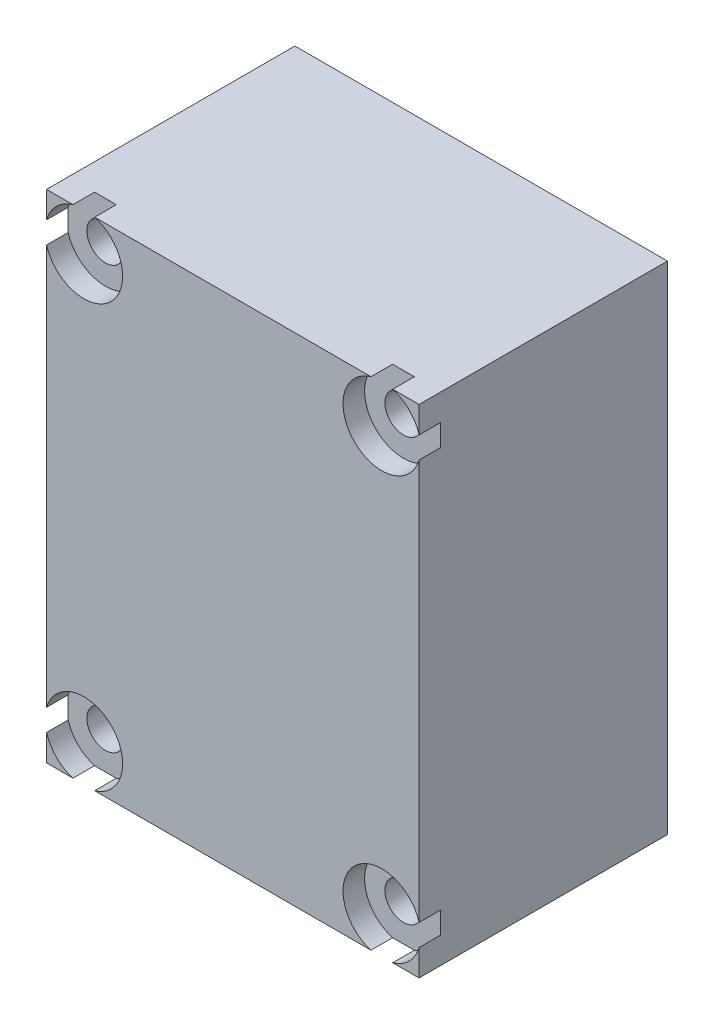
ISO-10303-21;
HEADER;
FILE_DESCRIPTION(('STEP AP214'),'2;1');
FILE_NAME('part.step','',(''),(''),'','','');
FILE_SCHEMA(('AUTOMOTIVE_DESIGN { 1 0 10303 214 1 1 1 1 }'));
ENDSEC;
DATA;
#1=APPLICATION_CONTEXT('core data for automotive mechanical design processes');
#2=APPLICATION_PROTOCOL_DEFINITION('international standard','automotive_design',2000,#1);
#3=PRODUCT_CONTEXT('',#1,'mechanical');
#4=PRODUCT('Part','Part','',(#3));
#5=PRODUCT_RELATED_PRODUCT_CATEGORY('part','',(#4));
#6=PRODUCT_DEFINITION_FORMATION('','',#4);
#7=PRODUCT_DEFINITION_CONTEXT('part definition',#1,'design');
#8=PRODUCT_DEFINITION('design','',#6,#7);
#9=PRODUCT_DEFINITION_SHAPE('','',#8);
#10=(LENGTH_UNIT() NAMED_UNIT(*) SI_UNIT(.MILLI.,.METRE.));
#11=(NAMED_UNIT(*) PLANE_ANGLE_UNIT() SI_UNIT($,.RADIAN.));
#12=(NAMED_UNIT(*) SI_UNIT($,.STERADIAN.) SOLID_ANGLE_UNIT());
#13=UNCERTAINTY_MEASURE_WITH_UNIT(LENGTH_MEASURE(1.E-05),#10,'distance_accuracy_value','');
#14=(GEOMETRIC_REPRESENTATION_CONTEXT(3) GLOBAL_UNCERTAINTY_ASSIGNED_CONTEXT((#13)) GLOBAL_UNIT_ASSIGNED_CONTEXT((#10,
#11,#12)) REPRESENTATION_CONTEXT('',''));
#15=CARTESIAN_POINT('',(0.,0.,0.));
#16=DIRECTION('',(0.,0.,1.));
#17=DIRECTION('',(1.,0.,0.));
#18=AXIS2_PLACEMENT_3D('',#15,#16,#17);
#19=CARTESIAN_POINT('',(0.,0.,25.4));
#20=DIRECTION('',(0.,0.,1.));
#21=DIRECTION('',(1.,0.,0.));
#22=AXIS2_PLACEMENT_3D('',#19,#20,#21);
#23=PLANE('',#22);
#24=CARTESIAN_POINT('',(-47.7550602409639,35.4375903614458,25.4));
#25=DIRECTION('',(0.,0.,1.));
#26=DIRECTION('',(1.,0.,0.));
#27=AXIS2_PLACEMENT_3D('',#24,#25,#26);
#28=CIRCLE('',#27,3.96875);
#29=CARTESIAN_POINT('',(-48.8663102409638,39.2475903614458,25.4));
#30=VERTEX_POINT('',#29);
#31=CARTESIAN_POINT('',(-51.5650602409639,36.5488403614458,25.4));
#32=VERTEX_POINT('',#31);
#33=EDGE_CURVE('E184',#30,#32,#28,.T.);
#34=ORIENTED_EDGE('',*,*,#33,.F.);
#35=DIRECTION('',(-1.,0.,0.));
#36=VECTOR('',#35,1.);
#37=CARTESIAN_POINT('',(-51.5650602409639,39.2475903614458,25.4));
#38=LINE('',#37,#36);
#39=CARTESIAN_POINT('',(-51.5650602409639,39.2475903614458,25.4));
#40=VERTEX_POINT('',#39);
#41=EDGE_CURVE('E245',#30,#40,#38,.T.);
#42=ORIENTED_EDGE('',*,*,#41,.T.);
#43=DIRECTION('',(0.,-1.,0.));
#44=VECTOR('',#43,1.);
#45=CARTESIAN_POINT('',(-51.5650602409639,39.2475903614458,25.4));
#46=LINE('',#45,#44);
#47=EDGE_CURVE('E256',#40,#32,#46,.T.);
#48=ORIENTED_EDGE('',*,*,#47,.T.);
#49=EDGE_LOOP('',(#34,#42,#48));
#50=FACE_BOUND('',#49,.T.);
#51=ADVANCED_FACE('F33',(#50),#23,.T.);
#52=CARTESIAN_POINT('',(-17.2750602409638,35.4375903614458,25.4));
#53=DIRECTION('',(0.,0.,1.));
#54=DIRECTION('',(1.,0.,0.));
#55=AXIS2_PLACEMENT_3D('',#52,#53,#54);
#56=CIRCLE('',#55,3.96875);
#57=CARTESIAN_POINT('',(-13.4650602409638,36.5488403614458,25.4));
#58=VERTEX_POINT('',#57);
#59=CARTESIAN_POINT('',(-16.1638102409638,39.2475903614458,25.4));
#60=VERTEX_POINT('',#59);
#61=EDGE_CURVE('E322',#58,#60,#56,.T.);
#62=ORIENTED_EDGE('',*,*,#61,.F.);
#63=DIRECTION('',(0.,1.,0.));
#64=VECTOR('',#63,1.);
#65=CARTESIAN_POINT('',(-13.4650602409638,39.2475903614458,25.4));
#66=LINE('',#65,#64);
#67=CARTESIAN_POINT('',(-13.4650602409638,39.2475903614458,25.4));
#68=VERTEX_POINT('',#67);
#69=EDGE_CURVE('E250',#58,#68,#66,.T.);
#70=ORIENTED_EDGE('',*,*,#69,.T.);
#71=EDGE_CURVE('E230',#68,#60,#38,.T.);
#72=ORIENTED_EDGE('',*,*,#71,.T.);
#73=EDGE_LOOP('',(#62,#70,#72));
#74=FACE_BOUND('',#73,.T.);
#75=ADVANCED_FACE('F392',(#74),#23,.T.);
#76=CARTESIAN_POINT('',(-47.7550602409639,-7.74240963855422,25.4));
#77=DIRECTION('',(0.,0.,1.));
#78=DIRECTION('',(1.,0.,0.));
#79=AXIS2_PLACEMENT_3D('',#76,#77,#78);
#80=CIRCLE('',#79,3.96875);
#81=CARTESIAN_POINT('',(-51.5650602409639,-8.85365963855422,25.4));
#82=VERTEX_POINT('',#81);
#83=CARTESIAN_POINT('',(-48.8663102409638,-11.5524096385542,25.4));
#84=VERTEX_POINT('',#83);
#85=EDGE_CURVE('E301',#82,#84,#80,.T.);
#86=ORIENTED_EDGE('',*,*,#85,.F.);
#87=CARTESIAN_POINT('',(-51.5650602409639,-11.5524096385542,25.4));
#88=VERTEX_POINT('',#87);
#89=EDGE_CURVE('E233',#82,#88,#46,.T.);
#90=ORIENTED_EDGE('',*,*,#89,.T.);
#91=DIRECTION('',(1.,0.,0.));
#92=VECTOR('',#91,1.);
#93=CARTESIAN_POINT('',(-51.5650602409639,-11.5524096385542,25.4));
#94=LINE('',#93,#92);
#95=EDGE_CURVE('E251',#88,#84,#94,.T.);
#96=ORIENTED_EDGE('',*,*,#95,.T.);
#97=EDGE_LOOP('',(#86,#90,#96));
#98=FACE_BOUND('',#97,.T.);
#99=ADVANCED_FACE('F417',(#98),#23,.T.);
#100=CARTESIAN_POINT('',(-51.5650602409639,34.3263403614458,25.4));
#101=VERTEX_POINT('',#100);
#102=CARTESIAN_POINT('',(-46.6438102409639,39.2475903614458,25.4));
#103=VERTEX_POINT('',#102);
#104=EDGE_CURVE('E174',#101,#103,#28,.T.);
#105=ORIENTED_EDGE('',*,*,#104,.F.);
#106=CARTESIAN_POINT('',(-51.5650602409639,-6.63115963855423,25.4));
#107=VERTEX_POINT('',#106);
#108=EDGE_CURVE('E259',#101,#107,#46,.T.);
#109=ORIENTED_EDGE('',*,*,#108,.T.);
#110=CARTESIAN_POINT('',(-46.6438102409639,-11.5524096385542,25.4));
#111=VERTEX_POINT('',#110);
#112=EDGE_CURVE('E302',#111,#107,#80,.T.);
#113=ORIENTED_EDGE('',*,*,#112,.F.);
#114=CARTESIAN_POINT('',(-18.3863102409638,-11.5524096385542,25.4));
#115=VERTEX_POINT('',#114);
#116=EDGE_CURVE('E254',#111,#115,#94,.T.);
#117=ORIENTED_EDGE('',*,*,#116,.T.);
#118=CARTESIAN_POINT('',(-17.2750602409638,-7.74240963855423,25.4));
#119=DIRECTION('',(0.,0.,1.));
#120=DIRECTION('',(1.,0.,0.));
#121=AXIS2_PLACEMENT_3D('',#118,#119,#120);
#122=CIRCLE('',#121,3.96875);
#123=CARTESIAN_POINT('',(-13.4650602409638,-6.63115963855423,25.4));
#124=VERTEX_POINT('',#123);
#125=EDGE_CURVE('E278',#124,#115,#122,.T.);
#126=ORIENTED_EDGE('',*,*,#125,.F.);
#127=CARTESIAN_POINT('',(-13.4650602409638,34.3263403614457,25.4));
#128=VERTEX_POINT('',#127);
#129=EDGE_CURVE('E249',#124,#128,#66,.T.);
#130=ORIENTED_EDGE('',*,*,#129,.T.);
#131=CARTESIAN_POINT('',(-18.3863102409638,39.2475903614458,25.4));
#132=VERTEX_POINT('',#131);
#133=EDGE_CURVE('E324',#132,#128,#56,.T.);
#134=ORIENTED_EDGE('',*,*,#133,.F.);
#135=EDGE_CURVE('E244',#132,#103,#38,.T.);
#136=ORIENTED_EDGE('',*,*,#135,.T.);
#137=EDGE_LOOP('',(#105,#109,#113,#117,#126,#130,#134,#136));
#138=FACE_BOUND('',#137,.T.);
#139=ADVANCED_FACE('F359',(#138),#23,.T.);
#140=CARTESIAN_POINT('',(-51.5650602409639,39.2475903614458,25.4));
#141=DIRECTION('',(1.,0.,0.));
#142=DIRECTION('',(0.,0.,-1.));
#143=AXIS2_PLACEMENT_3D('',#140,#141,#142);
#144=PLANE('',#143);
#145=DIRECTION('',(0.,1.,0.));
#146=VECTOR('',#145,1.);
#147=CARTESIAN_POINT('',(-51.5650602409639,39.2475903614458,23.1902));
#148=LINE('',#147,#146);
#149=CARTESIAN_POINT('',(-51.5650602409639,34.3263403614458,23.1902));
#150=VERTEX_POINT('',#149);
#151=CARTESIAN_POINT('',(-51.5650602409639,36.5488403614458,23.1902));
#152=VERTEX_POINT('',#151);
#153=EDGE_CURVE('E183',#150,#152,#148,.T.);
#154=ORIENTED_EDGE('',*,*,#153,.T.);
#155=DIRECTION('',(0.,0.,1.));
#156=VECTOR('',#155,1.);
#157=CARTESIAN_POINT('',(-51.5650602409639,36.5488403614458,25.4));
#158=LINE('',#157,#156);
#159=EDGE_CURVE('E326',#152,#32,#158,.T.);
#160=ORIENTED_EDGE('',*,*,#159,.T.);
#161=ORIENTED_EDGE('',*,*,#47,.F.);
#162=DIRECTION('',(0.,0.,-1.));
#163=VECTOR('',#162,1.);
#164=CARTESIAN_POINT('',(-51.5650602409639,39.2475903614458,25.4));
#165=LINE('',#164,#163);
#166=CARTESIAN_POINT('',(-51.5650602409639,39.2475903614458,0.));
#167=VERTEX_POINT('',#166);
#168=EDGE_CURVE('E227',#40,#167,#165,.T.);
#169=ORIENTED_EDGE('',*,*,#168,.T.);
#170=DIRECTION('',(0.,-1.,0.));
#171=VECTOR('',#170,1.);
#172=CARTESIAN_POINT('',(-51.5650602409639,39.2475903614458,0.));
#173=LINE('',#172,#171);
#174=CARTESIAN_POINT('',(-51.5650602409639,-11.5524096385542,0.));
#175=VERTEX_POINT('',#174);
#176=EDGE_CURVE('E238',#167,#175,#173,.T.);
#177=ORIENTED_EDGE('',*,*,#176,.T.);
#178=DIRECTION('',(0.,0.,-1.));
#179=VECTOR('',#178,1.);
#180=CARTESIAN_POINT('',(-51.5650602409639,-11.5524096385542,25.4));
#181=LINE('',#180,#179);
#182=EDGE_CURVE('E218',#88,#175,#181,.T.);
#183=ORIENTED_EDGE('',*,*,#182,.F.);
#184=ORIENTED_EDGE('',*,*,#89,.F.);
#185=DIRECTION('',(0.,0.,1.));
#186=VECTOR('',#185,1.);
#187=CARTESIAN_POINT('',(-51.5650602409639,-8.85365963855422,25.4));
#188=LINE('',#187,#186);
#189=CARTESIAN_POINT('',(-51.5650602409639,-8.85365963855422,23.1902));
#190=VERTEX_POINT('',#189);
#191=EDGE_CURVE('E206',#82,#190,#188,.F.);
#192=ORIENTED_EDGE('',*,*,#191,.T.);
#193=DIRECTION('',(0.,1.,0.));
#194=VECTOR('',#193,1.);
#195=CARTESIAN_POINT('',(-51.5650602409639,39.2475903614458,23.1902));
#196=LINE('',#195,#194);
#197=CARTESIAN_POINT('',(-51.5650602409639,-6.63115963855423,23.1902));
#198=VERTEX_POINT('',#197);
#199=EDGE_CURVE('E203',#190,#198,#196,.T.);
#200=ORIENTED_EDGE('',*,*,#199,.T.);
#201=DIRECTION('',(0.,0.,1.));
#202=VECTOR('',#201,1.);
#203=CARTESIAN_POINT('',(-51.5650602409639,-6.63115963855423,25.4));
#204=LINE('',#203,#202);
#205=EDGE_CURVE('E200',#198,#107,#204,.T.);
#206=ORIENTED_EDGE('',*,*,#205,.T.);
#207=ORIENTED_EDGE('',*,*,#108,.F.);
#208=DIRECTION('',(0.,0.,1.));
#209=VECTOR('',#208,1.);
#210=CARTESIAN_POINT('',(-51.5650602409639,34.3263403614458,25.4));
#211=LINE('',#210,#209);
#212=EDGE_CURVE('E329',#101,#150,#211,.F.);
#213=ORIENTED_EDGE('',*,*,#212,.T.);
#214=EDGE_LOOP('',(#154,#160,#161,#169,#177,#183,#184,#192,#200,#206,#207,#213));
#215=FACE_BOUND('',#214,.T.);
#216=ADVANCED_FACE('F35',(#215),#144,.F.);
#217=CARTESIAN_POINT('',(-51.5650602409639,-11.5524096385542,25.4));
#218=DIRECTION('',(0.,1.,0.));
#219=DIRECTION('',(-1.,0.,0.));
#220=AXIS2_PLACEMENT_3D('',#217,#218,#219);
#221=PLANE('',#220);
#222=DIRECTION('',(-1.,0.,0.));
#223=VECTOR('',#222,1.);
#224=CARTESIAN_POINT('',(-51.5650602409639,-11.5524096385542,23.1902));
#225=LINE('',#224,#223);
#226=CARTESIAN_POINT('',(-46.6438102409639,-11.5524096385542,23.1902));
#227=VERTEX_POINT('',#226);
#228=CARTESIAN_POINT('',(-48.8663102409638,-11.5524096385542,23.1902));
#229=VERTEX_POINT('',#228);
#230=EDGE_CURVE('E282',#227,#229,#225,.T.);
#231=ORIENTED_EDGE('',*,*,#230,.T.);
#232=DIRECTION('',(0.,0.,1.));
#233=VECTOR('',#232,1.);
#234=CARTESIAN_POINT('',(-48.8663102409638,-11.5524096385542,25.4));
#235=LINE('',#234,#233);
#236=EDGE_CURVE('E285',#229,#84,#235,.T.);
#237=ORIENTED_EDGE('',*,*,#236,.T.);
#238=ORIENTED_EDGE('',*,*,#95,.F.);
#239=ORIENTED_EDGE('',*,*,#182,.T.);
#240=DIRECTION('',(1.,0.,0.));
#241=VECTOR('',#240,1.);
#242=CARTESIAN_POINT('',(-51.5650602409639,-11.5524096385542,0.));
#243=LINE('',#242,#241);
#244=CARTESIAN_POINT('',(-13.4650602409638,-11.5524096385542,0.));
#245=VERTEX_POINT('',#244);
#246=EDGE_CURVE('E236',#175,#245,#243,.T.);
#247=ORIENTED_EDGE('',*,*,#246,.T.);
#248=DIRECTION('',(0.,0.,-1.));
#249=VECTOR('',#248,1.);
#250=CARTESIAN_POINT('',(-13.4650602409638,-11.5524096385542,25.4));
#251=LINE('',#250,#249);
#252=CARTESIAN_POINT('',(-13.4650602409638,-11.5524096385542,25.4));
#253=VERTEX_POINT('',#252);
#254=EDGE_CURVE('E221',#253,#245,#251,.T.);
#255=ORIENTED_EDGE('',*,*,#254,.F.);
#256=CARTESIAN_POINT('',(-16.1638102409639,-11.5524096385542,25.4));
#257=VERTEX_POINT('',#256);
#258=EDGE_CURVE('E255',#257,#253,#94,.T.);
#259=ORIENTED_EDGE('',*,*,#258,.F.);
#260=DIRECTION('',(0.,0.,1.));
#261=VECTOR('',#260,1.);
#262=CARTESIAN_POINT('',(-16.1638102409639,-11.5524096385542,25.4));
#263=LINE('',#262,#261);
#264=CARTESIAN_POINT('',(-16.1638102409639,-11.5524096385542,23.1902));
#265=VERTEX_POINT('',#264);
#266=EDGE_CURVE('E265',#257,#265,#263,.F.);
#267=ORIENTED_EDGE('',*,*,#266,.T.);
#268=DIRECTION('',(-1.,0.,0.));
#269=VECTOR('',#268,1.);
#270=CARTESIAN_POINT('',(-51.5650602409639,-11.5524096385542,23.1902));
#271=LINE('',#270,#269);
#272=CARTESIAN_POINT('',(-18.3863102409638,-11.5524096385542,23.1902));
#273=VERTEX_POINT('',#272);
#274=EDGE_CURVE('E241',#265,#273,#271,.T.);
#275=ORIENTED_EDGE('',*,*,#274,.T.);
#276=DIRECTION('',(0.,0.,1.));
#277=VECTOR('',#276,1.);
#278=CARTESIAN_POINT('',(-18.3863102409638,-11.5524096385542,25.4));
#279=LINE('',#278,#277);
#280=EDGE_CURVE('E262',#273,#115,#279,.T.);
#281=ORIENTED_EDGE('',*,*,#280,.T.);
#282=ORIENTED_EDGE('',*,*,#116,.F.);
#283=DIRECTION('',(0.,0.,1.));
#284=VECTOR('',#283,1.);
#285=CARTESIAN_POINT('',(-46.6438102409639,-11.5524096385542,25.4));
#286=LINE('',#285,#284);
#287=EDGE_CURVE('E288',#111,#227,#286,.F.);
#288=ORIENTED_EDGE('',*,*,#287,.T.);
#289=EDGE_LOOP('',(#231,#237,#238,#239,#247,#255,#259,#267,#275,#281,#282,#288));
#290=FACE_BOUND('',#289,.T.);
#291=ADVANCED_FACE('F352',(#290),#221,.F.);
#292=CARTESIAN_POINT('',(-13.4650602409638,39.2475903614458,25.4));
#293=DIRECTION('',(-1.,0.,0.));
#294=DIRECTION('',(0.,-1.,0.));
#295=AXIS2_PLACEMENT_3D('',#292,#293,#294);
#296=PLANE('',#295);
#297=DIRECTION('',(0.,-1.,0.));
#298=VECTOR('',#297,1.);
#299=CARTESIAN_POINT('',(-13.4650602409638,39.2475903614458,23.1902));
#300=LINE('',#299,#298);
#301=CARTESIAN_POINT('',(-13.4650602409638,36.5488403614458,23.1902));
#302=VERTEX_POINT('',#301);
#303=CARTESIAN_POINT('',(-13.4650602409638,34.3263403614457,23.1902));
#304=VERTEX_POINT('',#303);
#305=EDGE_CURVE('E194',#302,#304,#300,.T.);
#306=ORIENTED_EDGE('',*,*,#305,.T.);
#307=DIRECTION('',(0.,0.,1.));
#308=VECTOR('',#307,1.);
#309=CARTESIAN_POINT('',(-13.4650602409638,34.3263403614457,25.4));
#310=LINE('',#309,#308);
#311=EDGE_CURVE('E189',#304,#128,#310,.T.);
#312=ORIENTED_EDGE('',*,*,#311,.T.);
#313=ORIENTED_EDGE('',*,*,#129,.F.);
#314=DIRECTION('',(0.,0.,1.));
#315=VECTOR('',#314,1.);
#316=CARTESIAN_POINT('',(-13.4650602409638,-6.63115963855423,25.4));
#317=LINE('',#316,#315);
#318=CARTESIAN_POINT('',(-13.4650602409638,-6.63115963855423,23.1902));
#319=VERTEX_POINT('',#318);
#320=EDGE_CURVE('E215',#124,#319,#317,.F.);
#321=ORIENTED_EDGE('',*,*,#320,.T.);
#322=DIRECTION('',(0.,-1.,0.));
#323=VECTOR('',#322,1.);
#324=CARTESIAN_POINT('',(-13.4650602409638,39.2475903614458,23.1902));
#325=LINE('',#324,#323);
#326=CARTESIAN_POINT('',(-13.4650602409638,-8.85365963855422,23.1902));
#327=VERTEX_POINT('',#326);
#328=EDGE_CURVE('E212',#319,#327,#325,.T.);
#329=ORIENTED_EDGE('',*,*,#328,.T.);
#330=DIRECTION('',(0.,0.,1.));
#331=VECTOR('',#330,1.);
#332=CARTESIAN_POINT('',(-13.4650602409638,-8.85365963855422,25.4));
#333=LINE('',#332,#331);
#334=CARTESIAN_POINT('',(-13.4650602409638,-8.85365963855422,25.4));
#335=VERTEX_POINT('',#334);
#336=EDGE_CURVE('E209',#327,#335,#333,.T.);
#337=ORIENTED_EDGE('',*,*,#336,.T.);
#338=EDGE_CURVE('E246',#253,#335,#66,.T.);
#339=ORIENTED_EDGE('',*,*,#338,.F.);
#340=ORIENTED_EDGE('',*,*,#254,.T.);
#341=DIRECTION('',(0.,1.,0.));
#342=VECTOR('',#341,1.);
#343=CARTESIAN_POINT('',(-13.4650602409638,39.2475903614458,0.));
#344=LINE('',#343,#342);
#345=CARTESIAN_POINT('',(-13.4650602409638,39.2475903614458,0.));
#346=VERTEX_POINT('',#345);
#347=EDGE_CURVE('E234',#245,#346,#344,.T.);
#348=ORIENTED_EDGE('',*,*,#347,.T.);
#349=DIRECTION('',(0.,0.,-1.));
#350=VECTOR('',#349,1.);
#351=CARTESIAN_POINT('',(-13.4650602409638,39.2475903614458,25.4));
#352=LINE('',#351,#350);
#353=EDGE_CURVE('E224',#68,#346,#352,.T.);
#354=ORIENTED_EDGE('',*,*,#353,.F.);
#355=ORIENTED_EDGE('',*,*,#69,.F.);
#356=DIRECTION('',(0.,0.,1.));
#357=VECTOR('',#356,1.);
#358=CARTESIAN_POINT('',(-13.4650602409638,36.5488403614458,25.4));
#359=LINE('',#358,#357);
#360=EDGE_CURVE('E197',#58,#302,#359,.F.);
#361=ORIENTED_EDGE('',*,*,#360,.T.);
#362=EDGE_LOOP('',(#306,#312,#313,#321,#329,#337,#339,#340,#348,#354,#355,#361));
#363=FACE_BOUND('',#362,.T.);
#364=ADVANCED_FACE('F375',(#363),#296,.F.);
#365=CARTESIAN_POINT('',(-51.5650602409639,39.2475903614458,25.4));
#366=DIRECTION('',(0.,-1.,0.));
#367=DIRECTION('',(0.,0.,-1.));
#368=AXIS2_PLACEMENT_3D('',#365,#366,#367);
#369=PLANE('',#368);
#370=DIRECTION('',(1.,0.,0.));
#371=VECTOR('',#370,1.);
#372=CARTESIAN_POINT('',(-51.5650602409639,39.2475903614458,23.1902));
#373=LINE('',#372,#371);
#374=CARTESIAN_POINT('',(-48.8663102409638,39.2475903614458,23.1902));
#375=VERTEX_POINT('',#374);
#376=CARTESIAN_POINT('',(-46.6438102409639,39.2475903614458,23.1902));
#377=VERTEX_POINT('',#376);
#378=EDGE_CURVE('E41',#375,#377,#373,.T.);
#379=ORIENTED_EDGE('',*,*,#378,.T.);
#380=DIRECTION('',(0.,0.,1.));
#381=VECTOR('',#380,1.);
#382=CARTESIAN_POINT('',(-46.6438102409639,39.2475903614458,25.4));
#383=LINE('',#382,#381);
#384=EDGE_CURVE('E11',#377,#103,#383,.T.);
#385=ORIENTED_EDGE('',*,*,#384,.T.);
#386=ORIENTED_EDGE('',*,*,#135,.F.);
#387=DIRECTION('',(0.,0.,1.));
#388=VECTOR('',#387,1.);
#389=CARTESIAN_POINT('',(-18.3863102409638,39.2475903614458,25.4));
#390=LINE('',#389,#388);
#391=CARTESIAN_POINT('',(-18.3863102409638,39.2475903614458,23.1902));
#392=VERTEX_POINT('',#391);
#393=EDGE_CURVE('E311',#132,#392,#390,.F.);
#394=ORIENTED_EDGE('',*,*,#393,.T.);
#395=DIRECTION('',(1.,0.,0.));
#396=VECTOR('',#395,1.);
#397=CARTESIAN_POINT('',(-51.5650602409639,39.2475903614458,23.1902));
#398=LINE('',#397,#396);
#399=CARTESIAN_POINT('',(-16.1638102409638,39.2475903614458,23.1902));
#400=VERTEX_POINT('',#399);
#401=EDGE_CURVE('E305',#392,#400,#398,.T.);
#402=ORIENTED_EDGE('',*,*,#401,.T.);
#403=DIRECTION('',(0.,0.,1.));
#404=VECTOR('',#403,1.);
#405=CARTESIAN_POINT('',(-16.1638102409638,39.2475903614458,25.4));
#406=LINE('',#405,#404);
#407=EDGE_CURVE('E308',#400,#60,#406,.T.);
#408=ORIENTED_EDGE('',*,*,#407,.T.);
#409=ORIENTED_EDGE('',*,*,#71,.F.);
#410=ORIENTED_EDGE('',*,*,#353,.T.);
#411=DIRECTION('',(-1.,0.,0.));
#412=VECTOR('',#411,1.);
#413=CARTESIAN_POINT('',(-51.5650602409639,39.2475903614458,0.));
#414=LINE('',#413,#412);
#415=EDGE_CURVE('E231',#346,#167,#414,.T.);
#416=ORIENTED_EDGE('',*,*,#415,.T.);
#417=ORIENTED_EDGE('',*,*,#168,.F.);
#418=ORIENTED_EDGE('',*,*,#41,.F.);
#419=DIRECTION('',(0.,0.,1.));
#420=VECTOR('',#419,1.);
#421=CARTESIAN_POINT('',(-48.8663102409638,39.2475903614458,25.4));
#422=LINE('',#421,#420);
#423=EDGE_CURVE('E188',#30,#375,#422,.F.);
#424=ORIENTED_EDGE('',*,*,#423,.T.);
#425=EDGE_LOOP('',(#379,#385,#386,#394,#402,#408,#409,#410,#416,#417,#418,#424));
#426=FACE_BOUND('',#425,.T.);
#427=ADVANCED_FACE('F186',(#426),#369,.F.);
#428=EDGE_CURVE('E281',#257,#335,#122,.T.);
#429=ORIENTED_EDGE('',*,*,#428,.F.);
#430=ORIENTED_EDGE('',*,*,#258,.T.);
#431=ORIENTED_EDGE('',*,*,#338,.T.);
#432=EDGE_LOOP('',(#429,#430,#431));
#433=FACE_BOUND('',#432,.T.);
#434=ADVANCED_FACE('F372',(#433),#23,.T.);
#435=CARTESIAN_POINT('',(0.,0.,0.));
#436=DIRECTION('',(0.,0.,1.));
#437=DIRECTION('',(1.,0.,0.));
#438=AXIS2_PLACEMENT_3D('',#435,#436,#437);
#439=PLANE('',#438);
#440=CARTESIAN_POINT('',(-47.7550602409639,35.4375903614458,0.));
#441=DIRECTION('',(0.,0.,1.));
#442=DIRECTION('',(1.,0.,0.));
#443=AXIS2_PLACEMENT_3D('',#440,#441,#442);
#444=CIRCLE('',#443,1.89864999999999);
#445=CARTESIAN_POINT('',(-45.8564102409639,35.4375903614458,0.));
#446=VERTEX_POINT('',#445);
#447=EDGE_CURVE('E331',#446,#446,#444,.T.);
#448=ORIENTED_EDGE('',*,*,#447,.T.);
#449=EDGE_LOOP('',(#448));
#450=FACE_BOUND('',#449,.T.);
#451=CARTESIAN_POINT('',(-17.2750602409638,35.4375903614458,0.));
#452=DIRECTION('',(0.,0.,1.));
#453=DIRECTION('',(1.,0.,0.));
#454=AXIS2_PLACEMENT_3D('',#451,#452,#453);
#455=CIRCLE('',#454,1.89864999999999);
#456=CARTESIAN_POINT('',(-15.3764102409638,35.4375903614458,0.));
#457=VERTEX_POINT('',#456);
#458=EDGE_CURVE('E314',#457,#457,#455,.T.);
#459=ORIENTED_EDGE('',*,*,#458,.T.);
#460=EDGE_LOOP('',(#459));
#461=FACE_BOUND('',#460,.T.);
#462=CARTESIAN_POINT('',(-47.7550602409639,-7.74240963855422,0.));
#463=DIRECTION('',(0.,0.,1.));
#464=DIRECTION('',(1.,0.,0.));
#465=AXIS2_PLACEMENT_3D('',#462,#463,#464);
#466=CIRCLE('',#465,1.89864999999999);
#467=CARTESIAN_POINT('',(-45.8564102409639,-7.74240963855422,0.));
#468=VERTEX_POINT('',#467);
#469=EDGE_CURVE('E291',#468,#468,#466,.T.);
#470=ORIENTED_EDGE('',*,*,#469,.T.);
#471=EDGE_LOOP('',(#470));
#472=FACE_BOUND('',#471,.T.);
#473=CARTESIAN_POINT('',(-17.2750602409638,-7.74240963855423,0.));
#474=DIRECTION('',(0.,0.,1.));
#475=DIRECTION('',(1.,0.,0.));
#476=AXIS2_PLACEMENT_3D('',#473,#474,#475);
#477=CIRCLE('',#476,1.89864999999999);
#478=CARTESIAN_POINT('',(-15.3764102409638,-7.74240963855423,0.));
#479=VERTEX_POINT('',#478);
#480=EDGE_CURVE('E268',#479,#479,#477,.T.);
#481=ORIENTED_EDGE('',*,*,#480,.T.);
#482=EDGE_LOOP('',(#481));
#483=FACE_BOUND('',#482,.T.);
#484=ORIENTED_EDGE('',*,*,#176,.F.);
#485=ORIENTED_EDGE('',*,*,#415,.F.);
#486=ORIENTED_EDGE('',*,*,#347,.F.);
#487=ORIENTED_EDGE('',*,*,#246,.F.);
#488=EDGE_LOOP('',(#484,#485,#486,#487));
#489=FACE_BOUND('',#488,.T.);
#490=ADVANCED_FACE('F347',(#450,#461,#472,#483,#489),#439,.F.);
#491=CARTESIAN_POINT('',(-15.3764102409638,-7.74240963855423,23.1902));
#492=DIRECTION('',(0.,0.,-1.));
#493=DIRECTION('',(-1.,0.,0.));
#494=AXIS2_PLACEMENT_3D('',#491,#492,#493);
#495=PLANE('',#494);
#496=CARTESIAN_POINT('',(-17.2750602409638,-7.74240963855423,23.1902));
#497=DIRECTION('',(0.,0.,1.));
#498=DIRECTION('',(1.,0.,0.));
#499=AXIS2_PLACEMENT_3D('',#496,#497,#498);
#500=CIRCLE('',#499,1.89865);
#501=CARTESIAN_POINT('',(-15.3764102409638,-7.74240963855423,23.1902));
#502=VERTEX_POINT('',#501);
#503=EDGE_CURVE('E271',#502,#502,#500,.T.);
#504=ORIENTED_EDGE('',*,*,#503,.F.);
#505=EDGE_LOOP('',(#504));
#506=FACE_BOUND('',#505,.T.);
#507=CARTESIAN_POINT('',(-17.2750602409638,-7.74240963855423,23.1902));
#508=DIRECTION('',(0.,0.,1.));
#509=DIRECTION('',(1.,0.,0.));
#510=AXIS2_PLACEMENT_3D('',#507,#508,#509);
#511=CIRCLE('',#510,3.96875);
#512=EDGE_CURVE('E277',#265,#327,#511,.T.);
#513=ORIENTED_EDGE('',*,*,#512,.T.);
#514=ORIENTED_EDGE('',*,*,#328,.F.);
#515=EDGE_CURVE('E274',#319,#273,#511,.T.);
#516=ORIENTED_EDGE('',*,*,#515,.T.);
#517=ORIENTED_EDGE('',*,*,#274,.F.);
#518=EDGE_LOOP('',(#513,#514,#516,#517));
#519=FACE_BOUND('',#518,.T.);
#520=ADVANCED_FACE('F382',(#506,#519),#495,.F.);
#521=CARTESIAN_POINT('',(-17.2750602409638,-7.74240963855423,25.4));
#522=DIRECTION('',(0.,0.,1.));
#523=DIRECTION('',(1.,0.,0.));
#524=AXIS2_PLACEMENT_3D('',#521,#522,#523);
#525=CYLINDRICAL_SURFACE('',#524,3.96875);
#526=ORIENTED_EDGE('',*,*,#515,.F.);
#527=ORIENTED_EDGE('',*,*,#320,.F.);
#528=ORIENTED_EDGE('',*,*,#125,.T.);
#529=ORIENTED_EDGE('',*,*,#280,.F.);
#530=EDGE_LOOP('',(#526,#527,#528,#529));
#531=FACE_BOUND('',#530,.T.);
#532=ADVANCED_FACE('F384',(#531),#525,.F.);
#533=ORIENTED_EDGE('',*,*,#428,.T.);
#534=ORIENTED_EDGE('',*,*,#336,.F.);
#535=ORIENTED_EDGE('',*,*,#512,.F.);
#536=ORIENTED_EDGE('',*,*,#266,.F.);
#537=EDGE_LOOP('',(#533,#534,#535,#536));
#538=FACE_BOUND('',#537,.T.);
#539=ADVANCED_FACE('F380',(#538),#525,.F.);
#540=CARTESIAN_POINT('',(-17.2750602409638,-7.74240963855423,25.4));
#541=DIRECTION('',(0.,0.,1.));
#542=DIRECTION('',(1.,0.,0.));
#543=AXIS2_PLACEMENT_3D('',#540,#541,#542);
#544=CYLINDRICAL_SURFACE('',#543,1.89865);
#545=ORIENTED_EDGE('',*,*,#480,.F.);
#546=EDGE_LOOP('',(#545));
#547=FACE_BOUND('',#546,.T.);
#548=ORIENTED_EDGE('',*,*,#503,.T.);
#549=EDGE_LOOP('',(#548));
#550=FACE_BOUND('',#549,.T.);
#551=ADVANCED_FACE('F443',(#547,#550),#544,.F.);
#552=CARTESIAN_POINT('',(-45.8564102409638,-7.74240963855422,23.1902));
#553=DIRECTION('',(0.,0.,-1.));
#554=DIRECTION('',(-1.,0.,0.));
#555=AXIS2_PLACEMENT_3D('',#552,#553,#554);
#556=PLANE('',#555);
#557=CARTESIAN_POINT('',(-47.7550602409639,-7.74240963855422,23.1902));
#558=DIRECTION('',(0.,0.,1.));
#559=DIRECTION('',(1.,0.,0.));
#560=AXIS2_PLACEMENT_3D('',#557,#558,#559);
#561=CIRCLE('',#560,1.89865);
#562=CARTESIAN_POINT('',(-45.8564102409638,-7.74240963855422,23.1902));
#563=VERTEX_POINT('',#562);
#564=EDGE_CURVE('E294',#563,#563,#561,.T.);
#565=ORIENTED_EDGE('',*,*,#564,.F.);
#566=EDGE_LOOP('',(#565));
#567=FACE_BOUND('',#566,.T.);
#568=CARTESIAN_POINT('',(-47.7550602409639,-7.74240963855422,23.1902));
#569=DIRECTION('',(0.,0.,1.));
#570=DIRECTION('',(1.,0.,0.));
#571=AXIS2_PLACEMENT_3D('',#568,#569,#570);
#572=CIRCLE('',#571,3.96875);
#573=EDGE_CURVE('E298',#227,#198,#572,.T.);
#574=ORIENTED_EDGE('',*,*,#573,.T.);
#575=ORIENTED_EDGE('',*,*,#199,.F.);
#576=EDGE_CURVE('E297',#190,#229,#572,.T.);
#577=ORIENTED_EDGE('',*,*,#576,.T.);
#578=ORIENTED_EDGE('',*,*,#230,.F.);
#579=EDGE_LOOP('',(#574,#575,#577,#578));
#580=FACE_BOUND('',#579,.T.);
#581=ADVANCED_FACE('F367',(#567,#580),#556,.F.);
#582=CARTESIAN_POINT('',(-47.7550602409639,-7.74240963855422,25.4));
#583=DIRECTION('',(0.,0.,1.));
#584=DIRECTION('',(1.,0.,0.));
#585=AXIS2_PLACEMENT_3D('',#582,#583,#584);
#586=CYLINDRICAL_SURFACE('',#585,3.96875);
#587=ORIENTED_EDGE('',*,*,#576,.F.);
#588=ORIENTED_EDGE('',*,*,#191,.F.);
#589=ORIENTED_EDGE('',*,*,#85,.T.);
#590=ORIENTED_EDGE('',*,*,#236,.F.);
#591=EDGE_LOOP('',(#587,#588,#589,#590));
#592=FACE_BOUND('',#591,.T.);
#593=ADVANCED_FACE('F435',(#592),#586,.F.);
#594=ORIENTED_EDGE('',*,*,#112,.T.);
#595=ORIENTED_EDGE('',*,*,#205,.F.);
#596=ORIENTED_EDGE('',*,*,#573,.F.);
#597=ORIENTED_EDGE('',*,*,#287,.F.);
#598=EDGE_LOOP('',(#594,#595,#596,#597));
#599=FACE_BOUND('',#598,.T.);
#600=ADVANCED_FACE('F362',(#599),#586,.F.);
#601=CARTESIAN_POINT('',(-47.7550602409639,-7.74240963855422,25.4));
#602=DIRECTION('',(0.,0.,1.));
#603=DIRECTION('',(1.,0.,0.));
#604=AXIS2_PLACEMENT_3D('',#601,#602,#603);
#605=CYLINDRICAL_SURFACE('',#604,1.89865);
#606=ORIENTED_EDGE('',*,*,#469,.F.);
#607=EDGE_LOOP('',(#606));
#608=FACE_BOUND('',#607,.T.);
#609=ORIENTED_EDGE('',*,*,#564,.T.);
#610=EDGE_LOOP('',(#609));
#611=FACE_BOUND('',#610,.T.);
#612=ADVANCED_FACE('F442',(#608,#611),#605,.F.);
#613=CARTESIAN_POINT('',(-15.3764102409638,35.4375903614458,23.1902));
#614=DIRECTION('',(0.,0.,-1.));
#615=DIRECTION('',(-1.,0.,0.));
#616=AXIS2_PLACEMENT_3D('',#613,#614,#615);
#617=PLANE('',#616);
#618=CARTESIAN_POINT('',(-17.2750602409638,35.4375903614458,23.1902));
#619=DIRECTION('',(0.,0.,1.));
#620=DIRECTION('',(1.,0.,0.));
#621=AXIS2_PLACEMENT_3D('',#618,#619,#620);
#622=CIRCLE('',#621,1.89865);
#623=CARTESIAN_POINT('',(-15.3764102409638,35.4375903614458,23.1902));
#624=VERTEX_POINT('',#623);
#625=EDGE_CURVE('E317',#624,#624,#622,.T.);
#626=ORIENTED_EDGE('',*,*,#625,.F.);
#627=EDGE_LOOP('',(#626));
#628=FACE_BOUND('',#627,.T.);
#629=CARTESIAN_POINT('',(-17.2750602409638,35.4375903614458,23.1902));
#630=DIRECTION('',(0.,0.,1.));
#631=DIRECTION('',(1.,0.,0.));
#632=AXIS2_PLACEMENT_3D('',#629,#630,#631);
#633=CIRCLE('',#632,3.96875);
#634=EDGE_CURVE('E321',#392,#304,#633,.T.);
#635=ORIENTED_EDGE('',*,*,#634,.T.);
#636=ORIENTED_EDGE('',*,*,#305,.F.);
#637=EDGE_CURVE('E56',#302,#400,#633,.T.);
#638=ORIENTED_EDGE('',*,*,#637,.T.);
#639=ORIENTED_EDGE('',*,*,#401,.F.);
#640=EDGE_LOOP('',(#635,#636,#638,#639));
#641=FACE_BOUND('',#640,.T.);
#642=ADVANCED_FACE('F397',(#628,#641),#617,.F.);
#643=CARTESIAN_POINT('',(-17.2750602409638,35.4375903614458,25.4));
#644=DIRECTION('',(0.,0.,1.));
#645=DIRECTION('',(1.,0.,0.));
#646=AXIS2_PLACEMENT_3D('',#643,#644,#645);
#647=CYLINDRICAL_SURFACE('',#646,3.96875);
#648=ORIENTED_EDGE('',*,*,#637,.F.);
#649=ORIENTED_EDGE('',*,*,#360,.F.);
#650=ORIENTED_EDGE('',*,*,#61,.T.);
#651=ORIENTED_EDGE('',*,*,#407,.F.);
#652=EDGE_LOOP('',(#648,#649,#650,#651));
#653=FACE_BOUND('',#652,.T.);
#654=ADVANCED_FACE('F394',(#653),#647,.F.);
#655=ORIENTED_EDGE('',*,*,#133,.T.);
#656=ORIENTED_EDGE('',*,*,#311,.F.);
#657=ORIENTED_EDGE('',*,*,#634,.F.);
#658=ORIENTED_EDGE('',*,*,#393,.F.);
#659=EDGE_LOOP('',(#655,#656,#657,#658));
#660=FACE_BOUND('',#659,.T.);
#661=ADVANCED_FACE('F400',(#660),#647,.F.);
#662=CARTESIAN_POINT('',(-17.2750602409638,35.4375903614458,25.4));
#663=DIRECTION('',(0.,0.,1.));
#664=DIRECTION('',(1.,0.,0.));
#665=AXIS2_PLACEMENT_3D('',#662,#663,#664);
#666=CYLINDRICAL_SURFACE('',#665,1.89865);
#667=ORIENTED_EDGE('',*,*,#458,.F.);
#668=EDGE_LOOP('',(#667));
#669=FACE_BOUND('',#668,.T.);
#670=ORIENTED_EDGE('',*,*,#625,.T.);
#671=EDGE_LOOP('',(#670));
#672=FACE_BOUND('',#671,.T.);
#673=ADVANCED_FACE('F402',(#669,#672),#666,.F.);
#674=CARTESIAN_POINT('',(-45.8564102409638,35.4375903614458,23.1902));
#675=DIRECTION('',(0.,0.,-1.));
#676=DIRECTION('',(-1.,0.,0.));
#677=AXIS2_PLACEMENT_3D('',#674,#675,#676);
#678=PLANE('',#677);
#679=CARTESIAN_POINT('',(-47.7550602409639,35.4375903614458,23.1902));
#680=DIRECTION('',(0.,0.,1.));
#681=DIRECTION('',(1.,0.,0.));
#682=AXIS2_PLACEMENT_3D('',#679,#680,#681);
#683=CIRCLE('',#682,1.89865);
#684=CARTESIAN_POINT('',(-45.8564102409638,35.4375903614458,23.1902));
#685=VERTEX_POINT('',#684);
#686=EDGE_CURVE('E334',#685,#685,#683,.T.);
#687=ORIENTED_EDGE('',*,*,#686,.F.);
#688=EDGE_LOOP('',(#687));
#689=FACE_BOUND('',#688,.T.);
#690=CARTESIAN_POINT('',(-47.7550602409639,35.4375903614458,23.1902));
#691=DIRECTION('',(0.,0.,1.));
#692=DIRECTION('',(1.,0.,0.));
#693=AXIS2_PLACEMENT_3D('',#690,#691,#692);
#694=CIRCLE('',#693,3.96875);
#695=EDGE_CURVE('E171',#150,#377,#694,.T.);
#696=ORIENTED_EDGE('',*,*,#695,.T.);
#697=ORIENTED_EDGE('',*,*,#378,.F.);
#698=EDGE_CURVE('E48',#375,#152,#694,.T.);
#699=ORIENTED_EDGE('',*,*,#698,.T.);
#700=ORIENTED_EDGE('',*,*,#153,.F.);
#701=EDGE_LOOP('',(#696,#697,#699,#700));
#702=FACE_BOUND('',#701,.T.);
#703=ADVANCED_FACE('F180',(#689,#702),#678,.F.);
#704=CARTESIAN_POINT('',(-47.7550602409639,35.4375903614458,25.4));
#705=DIRECTION('',(0.,0.,1.));
#706=DIRECTION('',(1.,0.,0.));
#707=AXIS2_PLACEMENT_3D('',#704,#705,#706);
#708=CYLINDRICAL_SURFACE('',#707,3.96875);
#709=ORIENTED_EDGE('',*,*,#698,.F.);
#710=ORIENTED_EDGE('',*,*,#423,.F.);
#711=ORIENTED_EDGE('',*,*,#33,.T.);
#712=ORIENTED_EDGE('',*,*,#159,.F.);
#713=EDGE_LOOP('',(#709,#710,#711,#712));
#714=FACE_BOUND('',#713,.T.);
#715=ADVANCED_FACE('F338',(#714),#708,.F.);
#716=ORIENTED_EDGE('',*,*,#104,.T.);
#717=ORIENTED_EDGE('',*,*,#384,.F.);
#718=ORIENTED_EDGE('',*,*,#695,.F.);
#719=ORIENTED_EDGE('',*,*,#212,.F.);
#720=EDGE_LOOP('',(#716,#717,#718,#719));
#721=FACE_BOUND('',#720,.T.);
#722=ADVANCED_FACE('F170',(#721),#708,.F.);
#723=CARTESIAN_POINT('',(-47.7550602409639,35.4375903614458,25.4));
#724=DIRECTION('',(0.,0.,1.));
#725=DIRECTION('',(1.,0.,0.));
#726=AXIS2_PLACEMENT_3D('',#723,#724,#725);
#727=CYLINDRICAL_SURFACE('',#726,1.89865);
#728=ORIENTED_EDGE('',*,*,#447,.F.);
#729=EDGE_LOOP('',(#728));
#730=FACE_BOUND('',#729,.T.);
#731=ORIENTED_EDGE('',*,*,#686,.T.);
#732=EDGE_LOOP('',(#731));
#733=FACE_BOUND('',#732,.T.);
#734=ADVANCED_FACE('F601',(#730,#733),#727,.F.);
#735=CLOSED_SHELL('',(#51,#75,#99,#139,#216,#291,#364,#427,#434,#490,#520,#532,#539,#551,#581,
#593,#600,#612,#642,#654,#661,#673,#703,#715,#722,#734));
#736=MANIFOLD_SOLID_BREP('B2',#735);
#737=ADVANCED_BREP_SHAPE_REPRESENTATION('',(#18,#736),#14);
#738=SHAPE_DEFINITION_REPRESENTATION(#9,#737);
ENDSEC;
END-ISO-10303-21;
